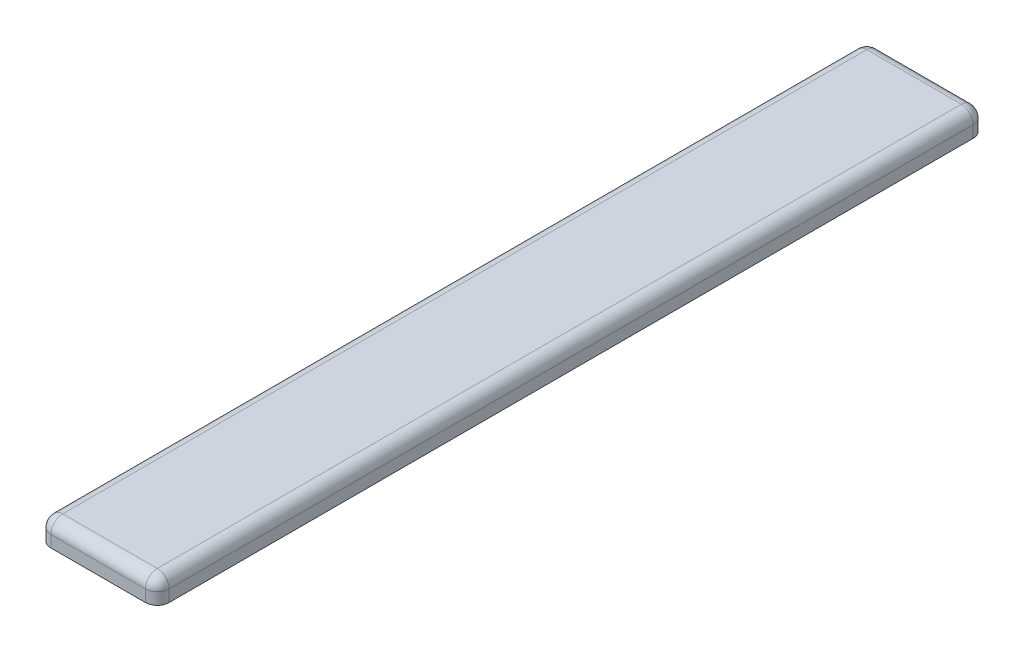
ISO-10303-21;
HEADER;
FILE_DESCRIPTION(('STEP AP214'),'2;1');
FILE_NAME('part.step','',(''),(''),'','','');
FILE_SCHEMA(('AUTOMOTIVE_DESIGN { 1 0 10303 214 1 1 1 1 }'));
ENDSEC;
DATA;
#1=APPLICATION_CONTEXT('core data for automotive mechanical design processes');
#2=APPLICATION_PROTOCOL_DEFINITION('international standard','automotive_design',2000,#1);
#3=PRODUCT_CONTEXT('',#1,'mechanical');
#4=PRODUCT('Part','Part','',(#3));
#5=PRODUCT_RELATED_PRODUCT_CATEGORY('part','',(#4));
#6=PRODUCT_DEFINITION_FORMATION('','',#4);
#7=PRODUCT_DEFINITION_CONTEXT('part definition',#1,'design');
#8=PRODUCT_DEFINITION('design','',#6,#7);
#9=PRODUCT_DEFINITION_SHAPE('','',#8);
#10=(LENGTH_UNIT() NAMED_UNIT(*) SI_UNIT(.MILLI.,.METRE.));
#11=(NAMED_UNIT(*) PLANE_ANGLE_UNIT() SI_UNIT($,.RADIAN.));
#12=(NAMED_UNIT(*) SI_UNIT($,.STERADIAN.) SOLID_ANGLE_UNIT());
#13=UNCERTAINTY_MEASURE_WITH_UNIT(LENGTH_MEASURE(1.E-05),#10,'distance_accuracy_value','');
#14=(GEOMETRIC_REPRESENTATION_CONTEXT(3) GLOBAL_UNCERTAINTY_ASSIGNED_CONTEXT((#13)) GLOBAL_UNIT_ASSIGNED_CONTEXT((#10,
#11,#12)) REPRESENTATION_CONTEXT('',''));
#15=CARTESIAN_POINT('',(0.,0.,0.));
#16=DIRECTION('',(0.,0.,1.));
#17=DIRECTION('',(1.,0.,0.));
#18=AXIS2_PLACEMENT_3D('',#15,#16,#17);
#19=CARTESIAN_POINT('',(0.,20.,0.));
#20=DIRECTION('',(1.,0.,0.));
#21=DIRECTION('',(0.,0.,-1.));
#22=AXIS2_PLACEMENT_3D('',#19,#20,#21);
#23=PLANE('',#22);
#24=DIRECTION('',(0.,0.,1.));
#25=VECTOR('',#24,1.);
#26=CARTESIAN_POINT('',(0.,0.,0.));
#27=LINE('',#26,#25);
#28=CARTESIAN_POINT('',(0.,0.,-690.));
#29=VERTEX_POINT('',#28);
#30=CARTESIAN_POINT('',(0.,0.,-10.));
#31=VERTEX_POINT('',#30);
#32=EDGE_CURVE('E197',#29,#31,#27,.T.);
#33=ORIENTED_EDGE('',*,*,#32,.T.);
#34=DIRECTION('',(0.,-1.,0.));
#35=VECTOR('',#34,1.);
#36=CARTESIAN_POINT('',(0.,20.,-10.));
#37=LINE('',#36,#35);
#38=CARTESIAN_POINT('',(0.,10.,-10.));
#39=VERTEX_POINT('',#38);
#40=EDGE_CURVE('E192',#31,#39,#37,.F.);
#41=ORIENTED_EDGE('',*,*,#40,.T.);
#42=DIRECTION('',(0.,0.,1.));
#43=VECTOR('',#42,1.);
#44=CARTESIAN_POINT('',(0.,10.,0.));
#45=LINE('',#44,#43);
#46=CARTESIAN_POINT('',(0.,10.,-690.));
#47=VERTEX_POINT('',#46);
#48=EDGE_CURVE('E165',#39,#47,#45,.F.);
#49=ORIENTED_EDGE('',*,*,#48,.T.);
#50=DIRECTION('',(0.,-1.,0.));
#51=VECTOR('',#50,1.);
#52=CARTESIAN_POINT('',(0.,20.,-690.));
#53=LINE('',#52,#51);
#54=EDGE_CURVE('E190',#47,#29,#53,.T.);
#55=ORIENTED_EDGE('',*,*,#54,.T.);
#56=EDGE_LOOP('',(#33,#41,#49,#55));
#57=FACE_BOUND('',#56,.T.);
#58=ADVANCED_FACE('F34',(#57),#23,.F.);
#59=CARTESIAN_POINT('',(0.,20.,0.));
#60=DIRECTION('',(0.,0.,-1.));
#61=DIRECTION('',(-1.,0.,0.));
#62=AXIS2_PLACEMENT_3D('',#59,#60,#61);
#63=PLANE('',#62);
#64=DIRECTION('',(1.,0.,0.));
#65=VECTOR('',#64,1.);
#66=CARTESIAN_POINT('',(0.,0.,0.));
#67=LINE('',#66,#65);
#68=CARTESIAN_POINT('',(10.,0.,0.));
#69=VERTEX_POINT('',#68);
#70=CARTESIAN_POINT('',(90.,0.,0.));
#71=VERTEX_POINT('',#70);
#72=EDGE_CURVE('E223',#69,#71,#67,.T.);
#73=ORIENTED_EDGE('',*,*,#72,.T.);
#74=DIRECTION('',(0.,-1.,0.));
#75=VECTOR('',#74,1.);
#76=CARTESIAN_POINT('',(90.,20.,0.));
#77=LINE('',#76,#75);
#78=CARTESIAN_POINT('',(90.,10.,0.));
#79=VERTEX_POINT('',#78);
#80=EDGE_CURVE('E188',#71,#79,#77,.F.);
#81=ORIENTED_EDGE('',*,*,#80,.T.);
#82=DIRECTION('',(1.,0.,0.));
#83=VECTOR('',#82,1.);
#84=CARTESIAN_POINT('',(0.,10.,0.));
#85=LINE('',#84,#83);
#86=CARTESIAN_POINT('',(10.,10.,0.));
#87=VERTEX_POINT('',#86);
#88=EDGE_CURVE('E163',#79,#87,#85,.F.);
#89=ORIENTED_EDGE('',*,*,#88,.T.);
#90=DIRECTION('',(0.,-1.,0.));
#91=VECTOR('',#90,1.);
#92=CARTESIAN_POINT('',(10.,20.,0.));
#93=LINE('',#92,#91);
#94=EDGE_CURVE('E58',#87,#69,#93,.T.);
#95=ORIENTED_EDGE('',*,*,#94,.T.);
#96=EDGE_LOOP('',(#73,#81,#89,#95));
#97=FACE_BOUND('',#96,.T.);
#98=ADVANCED_FACE('F246',(#97),#63,.F.);
#99=CARTESIAN_POINT('',(100.,20.,0.));
#100=DIRECTION('',(-1.,0.,0.));
#101=DIRECTION('',(0.,0.,1.));
#102=AXIS2_PLACEMENT_3D('',#99,#100,#101);
#103=PLANE('',#102);
#104=DIRECTION('',(0.,0.,-1.));
#105=VECTOR('',#104,1.);
#106=CARTESIAN_POINT('',(100.,10.,0.));
#107=LINE('',#106,#105);
#108=CARTESIAN_POINT('',(100.,10.,-690.));
#109=VERTEX_POINT('',#108);
#110=CARTESIAN_POINT('',(100.,10.,-10.));
#111=VERTEX_POINT('',#110);
#112=EDGE_CURVE('E156',#109,#111,#107,.F.);
#113=ORIENTED_EDGE('',*,*,#112,.T.);
#114=DIRECTION('',(0.,-1.,0.));
#115=VECTOR('',#114,1.);
#116=CARTESIAN_POINT('',(100.,20.,-10.));
#117=LINE('',#116,#115);
#118=CARTESIAN_POINT('',(100.,0.,-10.));
#119=VERTEX_POINT('',#118);
#120=EDGE_CURVE('E178',#111,#119,#117,.T.);
#121=ORIENTED_EDGE('',*,*,#120,.T.);
#122=DIRECTION('',(0.,0.,-1.));
#123=VECTOR('',#122,1.);
#124=CARTESIAN_POINT('',(100.,0.,0.));
#125=LINE('',#124,#123);
#126=CARTESIAN_POINT('',(100.,0.,-690.));
#127=VERTEX_POINT('',#126);
#128=EDGE_CURVE('E225',#119,#127,#125,.T.);
#129=ORIENTED_EDGE('',*,*,#128,.T.);
#130=DIRECTION('',(0.,-1.,0.));
#131=VECTOR('',#130,1.);
#132=CARTESIAN_POINT('',(100.,20.,-690.));
#133=LINE('',#132,#131);
#134=EDGE_CURVE('E137',#127,#109,#133,.F.);
#135=ORIENTED_EDGE('',*,*,#134,.T.);
#136=EDGE_LOOP('',(#113,#121,#129,#135));
#137=FACE_BOUND('',#136,.T.);
#138=ADVANCED_FACE('F244',(#137),#103,.F.);
#139=CARTESIAN_POINT('',(0.,20.,-700.));
#140=DIRECTION('',(0.,0.,1.));
#141=DIRECTION('',(1.,0.,0.));
#142=AXIS2_PLACEMENT_3D('',#139,#140,#141);
#143=PLANE('',#142);
#144=DIRECTION('',(-1.,0.,0.));
#145=VECTOR('',#144,1.);
#146=CARTESIAN_POINT('',(0.,0.,-700.));
#147=LINE('',#146,#145);
#148=CARTESIAN_POINT('',(90.,0.,-700.));
#149=VERTEX_POINT('',#148);
#150=CARTESIAN_POINT('',(10.,0.,-700.));
#151=VERTEX_POINT('',#150);
#152=EDGE_CURVE('E149',#149,#151,#147,.T.);
#153=ORIENTED_EDGE('',*,*,#152,.T.);
#154=DIRECTION('',(0.,-1.,0.));
#155=VECTOR('',#154,1.);
#156=CARTESIAN_POINT('',(10.,20.,-700.));
#157=LINE('',#156,#155);
#158=CARTESIAN_POINT('',(10.,10.,-700.));
#159=VERTEX_POINT('',#158);
#160=EDGE_CURVE('E11',#151,#159,#157,.F.);
#161=ORIENTED_EDGE('',*,*,#160,.T.);
#162=DIRECTION('',(-1.,0.,0.));
#163=VECTOR('',#162,1.);
#164=CARTESIAN_POINT('',(0.,10.,-700.));
#165=LINE('',#164,#163);
#166=CARTESIAN_POINT('',(90.,10.,-700.));
#167=VERTEX_POINT('',#166);
#168=EDGE_CURVE('E136',#159,#167,#165,.F.);
#169=ORIENTED_EDGE('',*,*,#168,.T.);
#170=DIRECTION('',(0.,-1.,0.));
#171=VECTOR('',#170,1.);
#172=CARTESIAN_POINT('',(90.,20.,-700.));
#173=LINE('',#172,#171);
#174=EDGE_CURVE('E43',#167,#149,#173,.T.);
#175=ORIENTED_EDGE('',*,*,#174,.T.);
#176=EDGE_LOOP('',(#153,#161,#169,#175));
#177=FACE_BOUND('',#176,.T.);
#178=ADVANCED_FACE('F211',(#177),#143,.F.);
#179=CARTESIAN_POINT('',(0.,20.,0.));
#180=DIRECTION('',(0.,-1.,0.));
#181=DIRECTION('',(0.,0.,-1.));
#182=AXIS2_PLACEMENT_3D('',#179,#180,#181);
#183=PLANE('',#182);
#184=DIRECTION('',(0.,0.,-1.));
#185=VECTOR('',#184,1.);
#186=CARTESIAN_POINT('',(90.,20.,0.));
#187=LINE('',#186,#185);
#188=CARTESIAN_POINT('',(90.,20.,-10.));
#189=VERTEX_POINT('',#188);
#190=CARTESIAN_POINT('',(90.,20.,-690.));
#191=VERTEX_POINT('',#190);
#192=EDGE_CURVE('E154',#189,#191,#187,.T.);
#193=ORIENTED_EDGE('',*,*,#192,.T.);
#194=DIRECTION('',(-1.,0.,0.));
#195=VECTOR('',#194,1.);
#196=CARTESIAN_POINT('',(0.,20.,-690.));
#197=LINE('',#196,#195);
#198=CARTESIAN_POINT('',(10.,20.,-690.));
#199=VERTEX_POINT('',#198);
#200=EDGE_CURVE('E133',#191,#199,#197,.T.);
#201=ORIENTED_EDGE('',*,*,#200,.T.);
#202=DIRECTION('',(0.,0.,1.));
#203=VECTOR('',#202,1.);
#204=CARTESIAN_POINT('',(10.,20.,0.));
#205=LINE('',#204,#203);
#206=CARTESIAN_POINT('',(10.,20.,-10.));
#207=VERTEX_POINT('',#206);
#208=EDGE_CURVE('E142',#199,#207,#205,.T.);
#209=ORIENTED_EDGE('',*,*,#208,.T.);
#210=DIRECTION('',(1.,0.,0.));
#211=VECTOR('',#210,1.);
#212=CARTESIAN_POINT('',(0.,20.,-10.));
#213=LINE('',#212,#211);
#214=EDGE_CURVE('E148',#207,#189,#213,.T.);
#215=ORIENTED_EDGE('',*,*,#214,.T.);
#216=EDGE_LOOP('',(#193,#201,#209,#215));
#217=FACE_BOUND('',#216,.T.);
#218=ADVANCED_FACE('F152',(#217),#183,.F.);
#219=CARTESIAN_POINT('',(0.,0.,0.));
#220=DIRECTION('',(0.,-1.,0.));
#221=DIRECTION('',(0.,0.,-1.));
#222=AXIS2_PLACEMENT_3D('',#219,#220,#221);
#223=PLANE('',#222);
#224=ORIENTED_EDGE('',*,*,#128,.F.);
#225=CARTESIAN_POINT('',(90.,0.,-10.));
#226=DIRECTION('',(0.,-1.,0.));
#227=DIRECTION('',(0.,0.,-1.));
#228=AXIS2_PLACEMENT_3D('',#225,#226,#227);
#229=CIRCLE('',#228,10.);
#230=EDGE_CURVE('E51',#119,#71,#229,.T.);
#231=ORIENTED_EDGE('',*,*,#230,.T.);
#232=ORIENTED_EDGE('',*,*,#72,.F.);
#233=CARTESIAN_POINT('',(10.,0.,-10.));
#234=DIRECTION('',(0.,-1.,0.));
#235=DIRECTION('',(0.,0.,-1.));
#236=AXIS2_PLACEMENT_3D('',#233,#234,#235);
#237=CIRCLE('',#236,10.);
#238=EDGE_CURVE('E184',#69,#31,#237,.T.);
#239=ORIENTED_EDGE('',*,*,#238,.T.);
#240=ORIENTED_EDGE('',*,*,#32,.F.);
#241=CARTESIAN_POINT('',(10.,0.,-690.));
#242=DIRECTION('',(0.,-1.,0.));
#243=DIRECTION('',(0.,0.,-1.));
#244=AXIS2_PLACEMENT_3D('',#241,#242,#243);
#245=CIRCLE('',#244,10.);
#246=EDGE_CURVE('E182',#29,#151,#245,.T.);
#247=ORIENTED_EDGE('',*,*,#246,.T.);
#248=ORIENTED_EDGE('',*,*,#152,.F.);
#249=CARTESIAN_POINT('',(90.,0.,-690.));
#250=DIRECTION('',(0.,-1.,0.));
#251=DIRECTION('',(0.,0.,-1.));
#252=AXIS2_PLACEMENT_3D('',#249,#250,#251);
#253=CIRCLE('',#252,10.);
#254=EDGE_CURVE('E180',#149,#127,#253,.T.);
#255=ORIENTED_EDGE('',*,*,#254,.T.);
#256=EDGE_LOOP('',(#224,#231,#232,#239,#240,#247,#248,#255));
#257=FACE_BOUND('',#256,.T.);
#258=ADVANCED_FACE('F221',(#257),#223,.T.);
#259=CARTESIAN_POINT('',(0.,10.,-10.));
#260=DIRECTION('',(1.,0.,0.));
#261=DIRECTION('',(0.,0.,-1.));
#262=AXIS2_PLACEMENT_3D('',#259,#260,#261);
#263=CYLINDRICAL_SURFACE('',#262,10.);
#264=ORIENTED_EDGE('',*,*,#88,.F.);
#265=CARTESIAN_POINT('',(90.,10.,-10.));
#266=DIRECTION('',(1.,0.,0.));
#267=DIRECTION('',(0.,0.,-1.));
#268=AXIS2_PLACEMENT_3D('',#265,#266,#267);
#269=CIRCLE('',#268,10.);
#270=EDGE_CURVE('E125',#79,#189,#269,.F.);
#271=ORIENTED_EDGE('',*,*,#270,.T.);
#272=ORIENTED_EDGE('',*,*,#214,.F.);
#273=CARTESIAN_POINT('',(10.,10.,-10.));
#274=DIRECTION('',(1.,0.,0.));
#275=DIRECTION('',(0.,0.,-1.));
#276=AXIS2_PLACEMENT_3D('',#273,#274,#275);
#277=CIRCLE('',#276,10.);
#278=EDGE_CURVE('E172',#207,#87,#277,.T.);
#279=ORIENTED_EDGE('',*,*,#278,.T.);
#280=EDGE_LOOP('',(#264,#271,#272,#279));
#281=FACE_BOUND('',#280,.T.);
#282=ADVANCED_FACE('F265',(#281),#263,.T.);
#283=CARTESIAN_POINT('',(90.,10.,0.));
#284=DIRECTION('',(0.,0.,-1.));
#285=DIRECTION('',(-1.,0.,0.));
#286=AXIS2_PLACEMENT_3D('',#283,#284,#285);
#287=CYLINDRICAL_SURFACE('',#286,10.);
#288=ORIENTED_EDGE('',*,*,#192,.F.);
#289=CARTESIAN_POINT('',(90.,10.,-10.));
#290=DIRECTION('',(0.,0.,-1.));
#291=DIRECTION('',(-1.,0.,0.));
#292=AXIS2_PLACEMENT_3D('',#289,#290,#291);
#293=CIRCLE('',#292,10.);
#294=EDGE_CURVE('E169',#189,#111,#293,.T.);
#295=ORIENTED_EDGE('',*,*,#294,.T.);
#296=ORIENTED_EDGE('',*,*,#112,.F.);
#297=CARTESIAN_POINT('',(90.,10.,-690.));
#298=DIRECTION('',(0.,0.,-1.));
#299=DIRECTION('',(-1.,0.,0.));
#300=AXIS2_PLACEMENT_3D('',#297,#298,#299);
#301=CIRCLE('',#300,10.);
#302=EDGE_CURVE('E167',#109,#191,#301,.F.);
#303=ORIENTED_EDGE('',*,*,#302,.T.);
#304=EDGE_LOOP('',(#288,#295,#296,#303));
#305=FACE_BOUND('',#304,.T.);
#306=ADVANCED_FACE('F233',(#305),#287,.T.);
#307=CARTESIAN_POINT('',(10.,10.,0.));
#308=DIRECTION('',(0.,0.,1.));
#309=DIRECTION('',(1.,0.,0.));
#310=AXIS2_PLACEMENT_3D('',#307,#308,#309);
#311=CYLINDRICAL_SURFACE('',#310,10.);
#312=ORIENTED_EDGE('',*,*,#48,.F.);
#313=CARTESIAN_POINT('',(10.,10.,-10.));
#314=DIRECTION('',(0.,0.,1.));
#315=DIRECTION('',(1.,0.,0.));
#316=AXIS2_PLACEMENT_3D('',#313,#314,#315);
#317=CIRCLE('',#316,10.);
#318=EDGE_CURVE('E124',#39,#207,#317,.F.);
#319=ORIENTED_EDGE('',*,*,#318,.T.);
#320=ORIENTED_EDGE('',*,*,#208,.F.);
#321=CARTESIAN_POINT('',(10.,10.,-690.));
#322=DIRECTION('',(0.,0.,1.));
#323=DIRECTION('',(1.,0.,0.));
#324=AXIS2_PLACEMENT_3D('',#321,#322,#323);
#325=CIRCLE('',#324,10.);
#326=EDGE_CURVE('E114',#199,#47,#325,.T.);
#327=ORIENTED_EDGE('',*,*,#326,.T.);
#328=EDGE_LOOP('',(#312,#319,#320,#327));
#329=FACE_BOUND('',#328,.T.);
#330=ADVANCED_FACE('F143',(#329),#311,.T.);
#331=CARTESIAN_POINT('',(0.,10.,-690.));
#332=DIRECTION('',(-1.,0.,0.));
#333=DIRECTION('',(0.,0.,1.));
#334=AXIS2_PLACEMENT_3D('',#331,#332,#333);
#335=CYLINDRICAL_SURFACE('',#334,10.);
#336=ORIENTED_EDGE('',*,*,#168,.F.);
#337=CARTESIAN_POINT('',(10.,10.,-690.));
#338=DIRECTION('',(-1.,0.,0.));
#339=DIRECTION('',(0.,0.,1.));
#340=AXIS2_PLACEMENT_3D('',#337,#338,#339);
#341=CIRCLE('',#340,10.);
#342=EDGE_CURVE('E117',#159,#199,#341,.F.);
#343=ORIENTED_EDGE('',*,*,#342,.T.);
#344=ORIENTED_EDGE('',*,*,#200,.F.);
#345=CARTESIAN_POINT('',(90.,10.,-690.));
#346=DIRECTION('',(-1.,0.,0.));
#347=DIRECTION('',(0.,0.,1.));
#348=AXIS2_PLACEMENT_3D('',#345,#346,#347);
#349=CIRCLE('',#348,10.);
#350=EDGE_CURVE('E138',#191,#167,#349,.T.);
#351=ORIENTED_EDGE('',*,*,#350,.T.);
#352=EDGE_LOOP('',(#336,#343,#344,#351));
#353=FACE_BOUND('',#352,.T.);
#354=ADVANCED_FACE('F130',(#353),#335,.T.);
#355=CARTESIAN_POINT('',(90.,20.,-10.));
#356=DIRECTION('',(0.,-1.,0.));
#357=DIRECTION('',(0.,0.,-1.));
#358=AXIS2_PLACEMENT_3D('',#355,#356,#357);
#359=CYLINDRICAL_SURFACE('',#358,10.);
#360=ORIENTED_EDGE('',*,*,#230,.F.);
#361=ORIENTED_EDGE('',*,*,#120,.F.);
#362=CARTESIAN_POINT('',(90.,10.,-10.));
#363=DIRECTION('',(0.,1.,0.));
#364=DIRECTION('',(0.,0.,1.));
#365=AXIS2_PLACEMENT_3D('',#362,#363,#364);
#366=CIRCLE('',#365,10.);
#367=EDGE_CURVE('E195',#79,#111,#366,.T.);
#368=ORIENTED_EDGE('',*,*,#367,.F.);
#369=ORIENTED_EDGE('',*,*,#80,.F.);
#370=EDGE_LOOP('',(#360,#361,#368,#369));
#371=FACE_BOUND('',#370,.T.);
#372=ADVANCED_FACE('F242',(#371),#359,.T.);
#373=CARTESIAN_POINT('',(90.,10.,-10.));
#374=DIRECTION('',(0.,0.,1.));
#375=DIRECTION('',(1.,0.,0.));
#376=AXIS2_PLACEMENT_3D('',#373,#374,#375);
#377=SPHERICAL_SURFACE('',#376,10.);
#378=ORIENTED_EDGE('',*,*,#294,.F.);
#379=ORIENTED_EDGE('',*,*,#270,.F.);
#380=ORIENTED_EDGE('',*,*,#367,.T.);
#381=EDGE_LOOP('',(#378,#379,#380));
#382=FACE_BOUND('',#381,.T.);
#383=ADVANCED_FACE('F237',(#382),#377,.T.);
#384=CARTESIAN_POINT('',(10.,20.,-10.));
#385=DIRECTION('',(0.,-1.,0.));
#386=DIRECTION('',(0.,0.,-1.));
#387=AXIS2_PLACEMENT_3D('',#384,#385,#386);
#388=CYLINDRICAL_SURFACE('',#387,10.);
#389=ORIENTED_EDGE('',*,*,#238,.F.);
#390=ORIENTED_EDGE('',*,*,#94,.F.);
#391=CARTESIAN_POINT('',(10.,10.,-10.));
#392=DIRECTION('',(0.,1.,0.));
#393=DIRECTION('',(0.,0.,1.));
#394=AXIS2_PLACEMENT_3D('',#391,#392,#393);
#395=CIRCLE('',#394,10.);
#396=EDGE_CURVE('E198',#39,#87,#395,.T.);
#397=ORIENTED_EDGE('',*,*,#396,.F.);
#398=ORIENTED_EDGE('',*,*,#40,.F.);
#399=EDGE_LOOP('',(#389,#390,#397,#398));
#400=FACE_BOUND('',#399,.T.);
#401=ADVANCED_FACE('F270',(#400),#388,.T.);
#402=CARTESIAN_POINT('',(10.,10.,-10.));
#403=DIRECTION('',(0.,0.,1.));
#404=DIRECTION('',(1.,0.,0.));
#405=AXIS2_PLACEMENT_3D('',#402,#403,#404);
#406=SPHERICAL_SURFACE('',#405,10.);
#407=ORIENTED_EDGE('',*,*,#396,.T.);
#408=ORIENTED_EDGE('',*,*,#278,.F.);
#409=ORIENTED_EDGE('',*,*,#318,.F.);
#410=EDGE_LOOP('',(#407,#408,#409));
#411=FACE_BOUND('',#410,.T.);
#412=ADVANCED_FACE('F273',(#411),#406,.T.);
#413=CARTESIAN_POINT('',(10.,20.,-690.));
#414=DIRECTION('',(0.,-1.,0.));
#415=DIRECTION('',(0.,0.,-1.));
#416=AXIS2_PLACEMENT_3D('',#413,#414,#415);
#417=CYLINDRICAL_SURFACE('',#416,10.);
#418=ORIENTED_EDGE('',*,*,#246,.F.);
#419=ORIENTED_EDGE('',*,*,#54,.F.);
#420=CARTESIAN_POINT('',(10.,10.,-690.));
#421=DIRECTION('',(0.,1.,0.));
#422=DIRECTION('',(0.,0.,1.));
#423=AXIS2_PLACEMENT_3D('',#420,#421,#422);
#424=CIRCLE('',#423,10.);
#425=EDGE_CURVE('E119',#159,#47,#424,.T.);
#426=ORIENTED_EDGE('',*,*,#425,.F.);
#427=ORIENTED_EDGE('',*,*,#160,.F.);
#428=EDGE_LOOP('',(#418,#419,#426,#427));
#429=FACE_BOUND('',#428,.T.);
#430=ADVANCED_FACE('F215',(#429),#417,.T.);
#431=CARTESIAN_POINT('',(10.,10.,-690.));
#432=DIRECTION('',(0.,0.,1.));
#433=DIRECTION('',(1.,0.,0.));
#434=AXIS2_PLACEMENT_3D('',#431,#432,#433);
#435=SPHERICAL_SURFACE('',#434,10.);
#436=ORIENTED_EDGE('',*,*,#425,.T.);
#437=ORIENTED_EDGE('',*,*,#326,.F.);
#438=ORIENTED_EDGE('',*,*,#342,.F.);
#439=EDGE_LOOP('',(#436,#437,#438));
#440=FACE_BOUND('',#439,.T.);
#441=ADVANCED_FACE('F116',(#440),#435,.T.);
#442=CARTESIAN_POINT('',(90.,20.,-690.));
#443=DIRECTION('',(0.,-1.,0.));
#444=DIRECTION('',(0.,0.,-1.));
#445=AXIS2_PLACEMENT_3D('',#442,#443,#444);
#446=CYLINDRICAL_SURFACE('',#445,10.);
#447=ORIENTED_EDGE('',*,*,#254,.F.);
#448=ORIENTED_EDGE('',*,*,#174,.F.);
#449=CARTESIAN_POINT('',(90.,10.,-690.));
#450=DIRECTION('',(0.,1.,0.));
#451=DIRECTION('',(0.,0.,1.));
#452=AXIS2_PLACEMENT_3D('',#449,#450,#451);
#453=CIRCLE('',#452,10.);
#454=EDGE_CURVE('E38',#109,#167,#453,.T.);
#455=ORIENTED_EDGE('',*,*,#454,.F.);
#456=ORIENTED_EDGE('',*,*,#134,.F.);
#457=EDGE_LOOP('',(#447,#448,#455,#456));
#458=FACE_BOUND('',#457,.T.);
#459=ADVANCED_FACE('F36',(#458),#446,.T.);
#460=CARTESIAN_POINT('',(90.,10.,-690.));
#461=DIRECTION('',(0.,0.,1.));
#462=DIRECTION('',(1.,0.,0.));
#463=AXIS2_PLACEMENT_3D('',#460,#461,#462);
#464=SPHERICAL_SURFACE('',#463,10.);
#465=ORIENTED_EDGE('',*,*,#350,.F.);
#466=ORIENTED_EDGE('',*,*,#302,.F.);
#467=ORIENTED_EDGE('',*,*,#454,.T.);
#468=EDGE_LOOP('',(#465,#466,#467));
#469=FACE_BOUND('',#468,.T.);
#470=ADVANCED_FACE('F204',(#469),#464,.T.);
#471=CLOSED_SHELL('',(#58,#98,#138,#178,#218,#258,#282,#306,#330,#354,#372,#383,#401,#412,#430,
#441,#459,#470));
#472=MANIFOLD_SOLID_BREP('B2',#471);
#473=ADVANCED_BREP_SHAPE_REPRESENTATION('',(#18,#472),#14);
#474=SHAPE_DEFINITION_REPRESENTATION(#9,#473);
ENDSEC;
END-ISO-10303-21;
